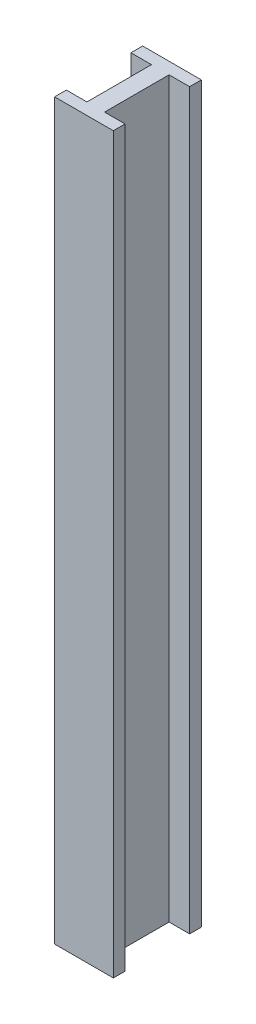
ISO-10303-21;
HEADER;
FILE_DESCRIPTION(('STEP AP214'),'2;1');
FILE_NAME('part.step','',(''),(''),'','','');
FILE_SCHEMA(('AUTOMOTIVE_DESIGN { 1 0 10303 214 1 1 1 1 }'));
ENDSEC;
DATA;
#1=APPLICATION_CONTEXT('core data for automotive mechanical design processes');
#2=APPLICATION_PROTOCOL_DEFINITION('international standard','automotive_design',2000,#1);
#3=PRODUCT_CONTEXT('',#1,'mechanical');
#4=PRODUCT('Part','Part','',(#3));
#5=PRODUCT_RELATED_PRODUCT_CATEGORY('part','',(#4));
#6=PRODUCT_DEFINITION_FORMATION('','',#4);
#7=PRODUCT_DEFINITION_CONTEXT('part definition',#1,'design');
#8=PRODUCT_DEFINITION('design','',#6,#7);
#9=PRODUCT_DEFINITION_SHAPE('','',#8);
#10=(LENGTH_UNIT() NAMED_UNIT(*) SI_UNIT(.MILLI.,.METRE.));
#11=(NAMED_UNIT(*) PLANE_ANGLE_UNIT() SI_UNIT($,.RADIAN.));
#12=(NAMED_UNIT(*) SI_UNIT($,.STERADIAN.) SOLID_ANGLE_UNIT());
#13=UNCERTAINTY_MEASURE_WITH_UNIT(LENGTH_MEASURE(1.E-05),#10,'distance_accuracy_value','');
#14=(GEOMETRIC_REPRESENTATION_CONTEXT(3) GLOBAL_UNCERTAINTY_ASSIGNED_CONTEXT((#13)) GLOBAL_UNIT_ASSIGNED_CONTEXT((#10,
#11,#12)) REPRESENTATION_CONTEXT('',''));
#15=CARTESIAN_POINT('',(0.,0.,0.));
#16=DIRECTION('',(0.,0.,1.));
#17=DIRECTION('',(1.,0.,0.));
#18=AXIS2_PLACEMENT_3D('',#15,#16,#17);
#19=CARTESIAN_POINT('',(-14.,500.,0.));
#20=DIRECTION('',(0.,0.,1.));
#21=DIRECTION('',(1.,0.,0.));
#22=AXIS2_PLACEMENT_3D('',#19,#20,#21);
#23=PLANE('',#22);
#24=DIRECTION('',(-1.,0.,0.));
#25=VECTOR('',#24,1.);
#26=CARTESIAN_POINT('',(-14.,0.,0.));
#27=LINE('',#26,#25);
#28=CARTESIAN_POINT('',(0.,0.,0.));
#29=VERTEX_POINT('',#28);
#30=CARTESIAN_POINT('',(-14.,0.,0.));
#31=VERTEX_POINT('',#30);
#32=EDGE_CURVE('E159',#29,#31,#27,.T.);
#33=ORIENTED_EDGE('',*,*,#32,.T.);
#34=DIRECTION('',(0.,-1.,0.));
#35=VECTOR('',#34,1.);
#36=CARTESIAN_POINT('',(-14.,500.,0.));
#37=LINE('',#36,#35);
#38=CARTESIAN_POINT('',(-14.,500.,0.));
#39=VERTEX_POINT('',#38);
#40=EDGE_CURVE('E11',#39,#31,#37,.T.);
#41=ORIENTED_EDGE('',*,*,#40,.F.);
#42=DIRECTION('',(-1.,0.,0.));
#43=VECTOR('',#42,1.);
#44=CARTESIAN_POINT('',(-14.,500.,0.));
#45=LINE('',#44,#43);
#46=CARTESIAN_POINT('',(0.,500.,0.));
#47=VERTEX_POINT('',#46);
#48=EDGE_CURVE('E181',#47,#39,#45,.T.);
#49=ORIENTED_EDGE('',*,*,#48,.F.);
#50=DIRECTION('',(0.,-1.,0.));
#51=VECTOR('',#50,1.);
#52=CARTESIAN_POINT('',(0.,500.,0.));
#53=LINE('',#52,#51);
#54=EDGE_CURVE('E155',#47,#29,#53,.T.);
#55=ORIENTED_EDGE('',*,*,#54,.T.);
#56=EDGE_LOOP('',(#33,#41,#49,#55));
#57=FACE_BOUND('',#56,.T.);
#58=ADVANCED_FACE('F39',(#57),#23,.F.);
#59=CARTESIAN_POINT('',(-14.,500.,8.));
#60=DIRECTION('',(1.,0.,0.));
#61=DIRECTION('',(0.,0.,-1.));
#62=AXIS2_PLACEMENT_3D('',#59,#60,#61);
#63=PLANE('',#62);
#64=DIRECTION('',(0.,0.,1.));
#65=VECTOR('',#64,1.);
#66=CARTESIAN_POINT('',(-14.,0.,8.));
#67=LINE('',#66,#65);
#68=CARTESIAN_POINT('',(-14.,0.,8.));
#69=VERTEX_POINT('',#68);
#70=EDGE_CURVE('E162',#31,#69,#67,.T.);
#71=ORIENTED_EDGE('',*,*,#70,.T.);
#72=DIRECTION('',(0.,-1.,0.));
#73=VECTOR('',#72,1.);
#74=CARTESIAN_POINT('',(-14.,500.,8.));
#75=LINE('',#74,#73);
#76=CARTESIAN_POINT('',(-14.,500.,8.));
#77=VERTEX_POINT('',#76);
#78=EDGE_CURVE('E47',#77,#69,#75,.T.);
#79=ORIENTED_EDGE('',*,*,#78,.F.);
#80=DIRECTION('',(0.,0.,1.));
#81=VECTOR('',#80,1.);
#82=CARTESIAN_POINT('',(-14.,500.,8.));
#83=LINE('',#82,#81);
#84=EDGE_CURVE('E110',#39,#77,#83,.T.);
#85=ORIENTED_EDGE('',*,*,#84,.F.);
#86=ORIENTED_EDGE('',*,*,#40,.T.);
#87=EDGE_LOOP('',(#71,#79,#85,#86));
#88=FACE_BOUND('',#87,.T.);
#89=ADVANCED_FACE('F259',(#88),#63,.F.);
#90=CARTESIAN_POINT('',(26.,500.,7.99999999999999));
#91=DIRECTION('',(0.,0.,-1.));
#92=DIRECTION('',(-1.,0.,0.));
#93=AXIS2_PLACEMENT_3D('',#90,#91,#92);
#94=PLANE('',#93);
#95=DIRECTION('',(1.,0.,0.));
#96=VECTOR('',#95,1.);
#97=CARTESIAN_POINT('',(26.,0.,7.99999999999999));
#98=LINE('',#97,#96);
#99=CARTESIAN_POINT('',(26.,0.,7.99999999999999));
#100=VERTEX_POINT('',#99);
#101=EDGE_CURVE('E164',#69,#100,#98,.T.);
#102=ORIENTED_EDGE('',*,*,#101,.T.);
#103=DIRECTION('',(0.,-1.,0.));
#104=VECTOR('',#103,1.);
#105=CARTESIAN_POINT('',(26.,500.,7.99999999999999));
#106=LINE('',#105,#104);
#107=CARTESIAN_POINT('',(26.,500.,7.99999999999999));
#108=VERTEX_POINT('',#107);
#109=EDGE_CURVE('E200',#108,#100,#106,.T.);
#110=ORIENTED_EDGE('',*,*,#109,.F.);
#111=DIRECTION('',(1.,0.,0.));
#112=VECTOR('',#111,1.);
#113=CARTESIAN_POINT('',(26.,500.,7.99999999999999));
#114=LINE('',#113,#112);
#115=EDGE_CURVE('E208',#77,#108,#114,.T.);
#116=ORIENTED_EDGE('',*,*,#115,.F.);
#117=ORIENTED_EDGE('',*,*,#78,.T.);
#118=EDGE_LOOP('',(#102,#110,#116,#117));
#119=FACE_BOUND('',#118,.T.);
#120=ADVANCED_FACE('F206',(#119),#94,.F.);
#121=CARTESIAN_POINT('',(26.,500.,0.));
#122=DIRECTION('',(-1.,0.,0.));
#123=DIRECTION('',(0.,0.,1.));
#124=AXIS2_PLACEMENT_3D('',#121,#122,#123);
#125=PLANE('',#124);
#126=DIRECTION('',(0.,0.,-1.));
#127=VECTOR('',#126,1.);
#128=CARTESIAN_POINT('',(26.,0.,0.));
#129=LINE('',#128,#127);
#130=CARTESIAN_POINT('',(26.,0.,0.));
#131=VERTEX_POINT('',#130);
#132=EDGE_CURVE('E166',#100,#131,#129,.T.);
#133=ORIENTED_EDGE('',*,*,#132,.T.);
#134=DIRECTION('',(0.,-1.,0.));
#135=VECTOR('',#134,1.);
#136=CARTESIAN_POINT('',(26.,500.,0.));
#137=LINE('',#136,#135);
#138=CARTESIAN_POINT('',(26.,500.,0.));
#139=VERTEX_POINT('',#138);
#140=EDGE_CURVE('E197',#139,#131,#137,.T.);
#141=ORIENTED_EDGE('',*,*,#140,.F.);
#142=DIRECTION('',(0.,0.,-1.));
#143=VECTOR('',#142,1.);
#144=CARTESIAN_POINT('',(26.,500.,0.));
#145=LINE('',#144,#143);
#146=EDGE_CURVE('E226',#108,#139,#145,.T.);
#147=ORIENTED_EDGE('',*,*,#146,.F.);
#148=ORIENTED_EDGE('',*,*,#109,.T.);
#149=EDGE_LOOP('',(#133,#141,#147,#148));
#150=FACE_BOUND('',#149,.T.);
#151=ADVANCED_FACE('F217',(#150),#125,.F.);
#152=CARTESIAN_POINT('',(12.,500.,0.));
#153=DIRECTION('',(0.,0.,1.));
#154=DIRECTION('',(1.,0.,0.));
#155=AXIS2_PLACEMENT_3D('',#152,#153,#154);
#156=PLANE('',#155);
#157=DIRECTION('',(-1.,0.,0.));
#158=VECTOR('',#157,1.);
#159=CARTESIAN_POINT('',(12.,0.,0.));
#160=LINE('',#159,#158);
#161=CARTESIAN_POINT('',(12.,0.,0.));
#162=VERTEX_POINT('',#161);
#163=EDGE_CURVE('E168',#131,#162,#160,.T.);
#164=ORIENTED_EDGE('',*,*,#163,.T.);
#165=DIRECTION('',(0.,-1.,0.));
#166=VECTOR('',#165,1.);
#167=CARTESIAN_POINT('',(12.,500.,0.));
#168=LINE('',#167,#166);
#169=CARTESIAN_POINT('',(12.,500.,0.));
#170=VERTEX_POINT('',#169);
#171=EDGE_CURVE('E194',#170,#162,#168,.T.);
#172=ORIENTED_EDGE('',*,*,#171,.F.);
#173=DIRECTION('',(-1.,0.,0.));
#174=VECTOR('',#173,1.);
#175=CARTESIAN_POINT('',(12.,500.,0.));
#176=LINE('',#175,#174);
#177=EDGE_CURVE('E223',#139,#170,#176,.T.);
#178=ORIENTED_EDGE('',*,*,#177,.F.);
#179=ORIENTED_EDGE('',*,*,#140,.T.);
#180=EDGE_LOOP('',(#164,#172,#178,#179));
#181=FACE_BOUND('',#180,.T.);
#182=ADVANCED_FACE('F221',(#181),#156,.F.);
#183=CARTESIAN_POINT('',(12.,500.,-44.));
#184=DIRECTION('',(-1.,0.,0.));
#185=DIRECTION('',(0.,0.,1.));
#186=AXIS2_PLACEMENT_3D('',#183,#184,#185);
#187=PLANE('',#186);
#188=DIRECTION('',(0.,0.,-1.));
#189=VECTOR('',#188,1.);
#190=CARTESIAN_POINT('',(12.,0.,-44.));
#191=LINE('',#190,#189);
#192=CARTESIAN_POINT('',(12.,0.,-44.));
#193=VERTEX_POINT('',#192);
#194=EDGE_CURVE('E170',#162,#193,#191,.T.);
#195=ORIENTED_EDGE('',*,*,#194,.T.);
#196=DIRECTION('',(0.,-1.,0.));
#197=VECTOR('',#196,1.);
#198=CARTESIAN_POINT('',(12.,500.,-44.));
#199=LINE('',#198,#197);
#200=CARTESIAN_POINT('',(12.,500.,-44.));
#201=VERTEX_POINT('',#200);
#202=EDGE_CURVE('E191',#201,#193,#199,.T.);
#203=ORIENTED_EDGE('',*,*,#202,.F.);
#204=DIRECTION('',(0.,0.,-1.));
#205=VECTOR('',#204,1.);
#206=CARTESIAN_POINT('',(12.,500.,-44.));
#207=LINE('',#206,#205);
#208=EDGE_CURVE('E225',#170,#201,#207,.T.);
#209=ORIENTED_EDGE('',*,*,#208,.F.);
#210=ORIENTED_EDGE('',*,*,#171,.T.);
#211=EDGE_LOOP('',(#195,#203,#209,#210));
#212=FACE_BOUND('',#211,.T.);
#213=ADVANCED_FACE('F272',(#212),#187,.F.);
#214=CARTESIAN_POINT('',(26.,500.,-44.));
#215=DIRECTION('',(0.,0.,-1.));
#216=DIRECTION('',(-1.,0.,0.));
#217=AXIS2_PLACEMENT_3D('',#214,#215,#216);
#218=PLANE('',#217);
#219=DIRECTION('',(1.,0.,0.));
#220=VECTOR('',#219,1.);
#221=CARTESIAN_POINT('',(26.,0.,-44.));
#222=LINE('',#221,#220);
#223=CARTESIAN_POINT('',(26.,0.,-44.));
#224=VERTEX_POINT('',#223);
#225=EDGE_CURVE('E172',#193,#224,#222,.T.);
#226=ORIENTED_EDGE('',*,*,#225,.T.);
#227=DIRECTION('',(0.,-1.,0.));
#228=VECTOR('',#227,1.);
#229=CARTESIAN_POINT('',(26.,500.,-44.));
#230=LINE('',#229,#228);
#231=CARTESIAN_POINT('',(26.,500.,-44.));
#232=VERTEX_POINT('',#231);
#233=EDGE_CURVE('E188',#232,#224,#230,.T.);
#234=ORIENTED_EDGE('',*,*,#233,.F.);
#235=DIRECTION('',(1.,0.,0.));
#236=VECTOR('',#235,1.);
#237=CARTESIAN_POINT('',(26.,500.,-44.));
#238=LINE('',#237,#236);
#239=EDGE_CURVE('E228',#201,#232,#238,.T.);
#240=ORIENTED_EDGE('',*,*,#239,.F.);
#241=ORIENTED_EDGE('',*,*,#202,.T.);
#242=EDGE_LOOP('',(#226,#234,#240,#241));
#243=FACE_BOUND('',#242,.T.);
#244=ADVANCED_FACE('F275',(#243),#218,.F.);
#245=CARTESIAN_POINT('',(26.,500.,-52.));
#246=DIRECTION('',(-1.,0.,0.));
#247=DIRECTION('',(0.,0.,1.));
#248=AXIS2_PLACEMENT_3D('',#245,#246,#247);
#249=PLANE('',#248);
#250=DIRECTION('',(0.,0.,-1.));
#251=VECTOR('',#250,1.);
#252=CARTESIAN_POINT('',(26.,0.,-52.));
#253=LINE('',#252,#251);
#254=CARTESIAN_POINT('',(26.,0.,-52.));
#255=VERTEX_POINT('',#254);
#256=EDGE_CURVE('E174',#224,#255,#253,.T.);
#257=ORIENTED_EDGE('',*,*,#256,.T.);
#258=DIRECTION('',(0.,-1.,0.));
#259=VECTOR('',#258,1.);
#260=CARTESIAN_POINT('',(26.,500.,-52.));
#261=LINE('',#260,#259);
#262=CARTESIAN_POINT('',(26.,500.,-52.));
#263=VERTEX_POINT('',#262);
#264=EDGE_CURVE('E185',#263,#255,#261,.T.);
#265=ORIENTED_EDGE('',*,*,#264,.F.);
#266=DIRECTION('',(0.,0.,-1.));
#267=VECTOR('',#266,1.);
#268=CARTESIAN_POINT('',(26.,500.,-52.));
#269=LINE('',#268,#267);
#270=EDGE_CURVE('E234',#232,#263,#269,.T.);
#271=ORIENTED_EDGE('',*,*,#270,.F.);
#272=ORIENTED_EDGE('',*,*,#233,.T.);
#273=EDGE_LOOP('',(#257,#265,#271,#272));
#274=FACE_BOUND('',#273,.T.);
#275=ADVANCED_FACE('F240',(#274),#249,.F.);
#276=CARTESIAN_POINT('',(-14.,500.,-52.));
#277=DIRECTION('',(0.,0.,1.));
#278=DIRECTION('',(1.,0.,0.));
#279=AXIS2_PLACEMENT_3D('',#276,#277,#278);
#280=PLANE('',#279);
#281=DIRECTION('',(-1.,0.,0.));
#282=VECTOR('',#281,1.);
#283=CARTESIAN_POINT('',(-14.,0.,-52.));
#284=LINE('',#283,#282);
#285=CARTESIAN_POINT('',(-14.,0.,-52.));
#286=VERTEX_POINT('',#285);
#287=EDGE_CURVE('E176',#255,#286,#284,.T.);
#288=ORIENTED_EDGE('',*,*,#287,.T.);
#289=DIRECTION('',(0.,-1.,0.));
#290=VECTOR('',#289,1.);
#291=CARTESIAN_POINT('',(-14.,500.,-52.));
#292=LINE('',#291,#290);
#293=CARTESIAN_POINT('',(-14.,500.,-52.));
#294=VERTEX_POINT('',#293);
#295=EDGE_CURVE('E150',#294,#286,#292,.T.);
#296=ORIENTED_EDGE('',*,*,#295,.F.);
#297=DIRECTION('',(-1.,0.,0.));
#298=VECTOR('',#297,1.);
#299=CARTESIAN_POINT('',(-14.,500.,-52.));
#300=LINE('',#299,#298);
#301=EDGE_CURVE('E141',#263,#294,#300,.T.);
#302=ORIENTED_EDGE('',*,*,#301,.F.);
#303=ORIENTED_EDGE('',*,*,#264,.T.);
#304=EDGE_LOOP('',(#288,#296,#302,#303));
#305=FACE_BOUND('',#304,.T.);
#306=ADVANCED_FACE('F244',(#305),#280,.F.);
#307=CARTESIAN_POINT('',(-14.,500.,-44.));
#308=DIRECTION('',(1.,0.,0.));
#309=DIRECTION('',(0.,0.,-1.));
#310=AXIS2_PLACEMENT_3D('',#307,#308,#309);
#311=PLANE('',#310);
#312=DIRECTION('',(0.,0.,1.));
#313=VECTOR('',#312,1.);
#314=CARTESIAN_POINT('',(-14.,0.,-44.));
#315=LINE('',#314,#313);
#316=CARTESIAN_POINT('',(-14.,0.,-44.));
#317=VERTEX_POINT('',#316);
#318=EDGE_CURVE('E149',#286,#317,#315,.T.);
#319=ORIENTED_EDGE('',*,*,#318,.T.);
#320=DIRECTION('',(0.,-1.,0.));
#321=VECTOR('',#320,1.);
#322=CARTESIAN_POINT('',(-14.,500.,-44.));
#323=LINE('',#322,#321);
#324=CARTESIAN_POINT('',(-14.,500.,-44.));
#325=VERTEX_POINT('',#324);
#326=EDGE_CURVE('E146',#325,#317,#323,.T.);
#327=ORIENTED_EDGE('',*,*,#326,.F.);
#328=DIRECTION('',(0.,0.,1.));
#329=VECTOR('',#328,1.);
#330=CARTESIAN_POINT('',(-14.,500.,-44.));
#331=LINE('',#330,#329);
#332=EDGE_CURVE('E135',#294,#325,#331,.T.);
#333=ORIENTED_EDGE('',*,*,#332,.F.);
#334=ORIENTED_EDGE('',*,*,#295,.T.);
#335=EDGE_LOOP('',(#319,#327,#333,#334));
#336=FACE_BOUND('',#335,.T.);
#337=ADVANCED_FACE('F147',(#336),#311,.F.);
#338=CARTESIAN_POINT('',(0.,500.,-44.));
#339=DIRECTION('',(0.,0.,-1.));
#340=DIRECTION('',(-1.,0.,0.));
#341=AXIS2_PLACEMENT_3D('',#338,#339,#340);
#342=PLANE('',#341);
#343=DIRECTION('',(1.,0.,0.));
#344=VECTOR('',#343,1.);
#345=CARTESIAN_POINT('',(0.,0.,-44.));
#346=LINE('',#345,#344);
#347=CARTESIAN_POINT('',(0.,0.,-44.));
#348=VERTEX_POINT('',#347);
#349=EDGE_CURVE('E96',#317,#348,#346,.T.);
#350=ORIENTED_EDGE('',*,*,#349,.T.);
#351=DIRECTION('',(0.,-1.,0.));
#352=VECTOR('',#351,1.);
#353=CARTESIAN_POINT('',(0.,500.,-44.));
#354=LINE('',#353,#352);
#355=CARTESIAN_POINT('',(0.,500.,-44.));
#356=VERTEX_POINT('',#355);
#357=EDGE_CURVE('E151',#356,#348,#354,.T.);
#358=ORIENTED_EDGE('',*,*,#357,.F.);
#359=DIRECTION('',(1.,0.,0.));
#360=VECTOR('',#359,1.);
#361=CARTESIAN_POINT('',(0.,500.,-44.));
#362=LINE('',#361,#360);
#363=EDGE_CURVE('E139',#325,#356,#362,.T.);
#364=ORIENTED_EDGE('',*,*,#363,.F.);
#365=ORIENTED_EDGE('',*,*,#326,.T.);
#366=EDGE_LOOP('',(#350,#358,#364,#365));
#367=FACE_BOUND('',#366,.T.);
#368=ADVANCED_FACE('F153',(#367),#342,.F.);
#369=CARTESIAN_POINT('',(0.,500.,0.));
#370=DIRECTION('',(1.,0.,0.));
#371=DIRECTION('',(0.,0.,-1.));
#372=AXIS2_PLACEMENT_3D('',#369,#370,#371);
#373=PLANE('',#372);
#374=DIRECTION('',(0.,0.,1.));
#375=VECTOR('',#374,1.);
#376=CARTESIAN_POINT('',(0.,0.,0.));
#377=LINE('',#376,#375);
#378=EDGE_CURVE('E102',#348,#29,#377,.T.);
#379=ORIENTED_EDGE('',*,*,#378,.T.);
#380=ORIENTED_EDGE('',*,*,#54,.F.);
#381=DIRECTION('',(0.,0.,1.));
#382=VECTOR('',#381,1.);
#383=CARTESIAN_POINT('',(0.,500.,0.));
#384=LINE('',#383,#382);
#385=EDGE_CURVE('E55',#356,#47,#384,.T.);
#386=ORIENTED_EDGE('',*,*,#385,.F.);
#387=ORIENTED_EDGE('',*,*,#357,.T.);
#388=EDGE_LOOP('',(#379,#380,#386,#387));
#389=FACE_BOUND('',#388,.T.);
#390=ADVANCED_FACE('F248',(#389),#373,.F.);
#391=CARTESIAN_POINT('',(0.,500.,0.));
#392=DIRECTION('',(0.,1.,0.));
#393=DIRECTION('',(0.,0.,1.));
#394=AXIS2_PLACEMENT_3D('',#391,#392,#393);
#395=PLANE('',#394);
#396=ORIENTED_EDGE('',*,*,#48,.T.);
#397=ORIENTED_EDGE('',*,*,#84,.T.);
#398=ORIENTED_EDGE('',*,*,#115,.T.);
#399=ORIENTED_EDGE('',*,*,#146,.T.);
#400=ORIENTED_EDGE('',*,*,#177,.T.);
#401=ORIENTED_EDGE('',*,*,#208,.T.);
#402=ORIENTED_EDGE('',*,*,#239,.T.);
#403=ORIENTED_EDGE('',*,*,#270,.T.);
#404=ORIENTED_EDGE('',*,*,#301,.T.);
#405=ORIENTED_EDGE('',*,*,#332,.T.);
#406=ORIENTED_EDGE('',*,*,#363,.T.);
#407=ORIENTED_EDGE('',*,*,#385,.T.);
#408=EDGE_LOOP('',(#396,#397,#398,#399,#400,#401,#402,#403,#404,#405,#406,#407));
#409=FACE_BOUND('',#408,.T.);
#410=ADVANCED_FACE('F137',(#409),#395,.T.);
#411=CARTESIAN_POINT('',(0.,0.,0.));
#412=DIRECTION('',(0.,1.,0.));
#413=DIRECTION('',(0.,0.,1.));
#414=AXIS2_PLACEMENT_3D('',#411,#412,#413);
#415=PLANE('',#414);
#416=ORIENTED_EDGE('',*,*,#32,.F.);
#417=ORIENTED_EDGE('',*,*,#378,.F.);
#418=ORIENTED_EDGE('',*,*,#349,.F.);
#419=ORIENTED_EDGE('',*,*,#318,.F.);
#420=ORIENTED_EDGE('',*,*,#287,.F.);
#421=ORIENTED_EDGE('',*,*,#256,.F.);
#422=ORIENTED_EDGE('',*,*,#225,.F.);
#423=ORIENTED_EDGE('',*,*,#194,.F.);
#424=ORIENTED_EDGE('',*,*,#163,.F.);
#425=ORIENTED_EDGE('',*,*,#132,.F.);
#426=ORIENTED_EDGE('',*,*,#101,.F.);
#427=ORIENTED_EDGE('',*,*,#70,.F.);
#428=EDGE_LOOP('',(#416,#417,#418,#419,#420,#421,#422,#423,#424,#425,#426,#427));
#429=FACE_BOUND('',#428,.T.);
#430=ADVANCED_FACE('F212',(#429),#415,.F.);
#431=CLOSED_SHELL('',(#58,#89,#120,#151,#182,#213,#244,#275,#306,#337,#368,#390,#410,#430));
#432=MANIFOLD_SOLID_BREP('B2',#431);
#433=ADVANCED_BREP_SHAPE_REPRESENTATION('',(#18,#432),#14);
#434=SHAPE_DEFINITION_REPRESENTATION(#9,#433);
ENDSEC;
END-ISO-10303-21;
